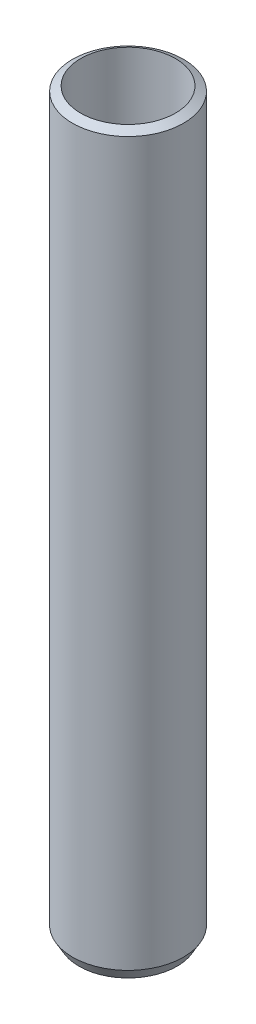
ISO-10303-21;
HEADER;
FILE_DESCRIPTION(('STEP AP214'),'2;1');
FILE_NAME('part.step','',(''),(''),'','','');
FILE_SCHEMA(('AUTOMOTIVE_DESIGN { 1 0 10303 214 1 1 1 1 }'));
ENDSEC;
DATA;
#1=APPLICATION_CONTEXT('core data for automotive mechanical design processes');
#2=APPLICATION_PROTOCOL_DEFINITION('international standard','automotive_design',2000,#1);
#3=PRODUCT_CONTEXT('',#1,'mechanical');
#4=PRODUCT('Part','Part','',(#3));
#5=PRODUCT_RELATED_PRODUCT_CATEGORY('part','',(#4));
#6=PRODUCT_DEFINITION_FORMATION('','',#4);
#7=PRODUCT_DEFINITION_CONTEXT('part definition',#1,'design');
#8=PRODUCT_DEFINITION('design','',#6,#7);
#9=PRODUCT_DEFINITION_SHAPE('','',#8);
#10=(LENGTH_UNIT() NAMED_UNIT(*) SI_UNIT(.MILLI.,.METRE.));
#11=(NAMED_UNIT(*) PLANE_ANGLE_UNIT() SI_UNIT($,.RADIAN.));
#12=(NAMED_UNIT(*) SI_UNIT($,.STERADIAN.) SOLID_ANGLE_UNIT());
#13=UNCERTAINTY_MEASURE_WITH_UNIT(LENGTH_MEASURE(1.E-05),#10,'distance_accuracy_value','');
#14=(GEOMETRIC_REPRESENTATION_CONTEXT(3) GLOBAL_UNCERTAINTY_ASSIGNED_CONTEXT((#13)) GLOBAL_UNIT_ASSIGNED_CONTEXT((#10,
#11,#12)) REPRESENTATION_CONTEXT('',''));
#15=CARTESIAN_POINT('',(0.,0.,0.));
#16=DIRECTION('',(0.,0.,1.));
#17=DIRECTION('',(1.,0.,0.));
#18=AXIS2_PLACEMENT_3D('',#15,#16,#17);
#19=CARTESIAN_POINT('',(0.,600.,0.));
#20=DIRECTION('',(0.,-1.,0.));
#21=DIRECTION('',(0.,0.,-1.));
#22=AXIS2_PLACEMENT_3D('',#19,#20,#21);
#23=CYLINDRICAL_SURFACE('',#22,45.);
#24=CARTESIAN_POINT('',(0.,594.780296499241,0.));
#25=DIRECTION('',(0.,1.,0.));
#26=DIRECTION('',(0.,0.,1.));
#27=AXIS2_PLACEMENT_3D('',#24,#25,#26);
#28=CIRCLE('',#27,45.);
#29=CARTESIAN_POINT('',(0.,594.780296499241,-45.0000000000001));
#30=VERTEX_POINT('',#29);
#31=EDGE_CURVE('E50',#30,#30,#28,.F.);
#32=ORIENTED_EDGE('',*,*,#31,.T.);
#33=EDGE_LOOP('',(#32));
#34=FACE_BOUND('',#33,.T.);
#35=CARTESIAN_POINT('',(0.,9.04079166376015,0.));
#36=DIRECTION('',(0.,1.,0.));
#37=DIRECTION('',(0.,0.,1.));
#38=AXIS2_PLACEMENT_3D('',#35,#36,#37);
#39=CIRCLE('',#38,45.);
#40=CARTESIAN_POINT('',(0.,9.04079166376015,45.));
#41=VERTEX_POINT('',#40);
#42=EDGE_CURVE('E51',#41,#41,#39,.T.);
#43=ORIENTED_EDGE('',*,*,#42,.T.);
#44=EDGE_LOOP('',(#43));
#45=FACE_BOUND('',#44,.T.);
#46=ADVANCED_FACE('F39',(#34,#45),#23,.T.);
#47=CARTESIAN_POINT('',(0.,0.,0.));
#48=DIRECTION('',(0.,1.,0.));
#49=DIRECTION('',(0.,0.,1.));
#50=AXIS2_PLACEMENT_3D('',#47,#48,#49);
#51=PLANE('',#50);
#52=CARTESIAN_POINT('',(0.,0.,0.));
#53=DIRECTION('',(0.,1.,0.));
#54=DIRECTION('',(0.,0.,1.));
#55=AXIS2_PLACEMENT_3D('',#52,#53,#54);
#56=CIRCLE('',#55,39.7802964992408);
#57=CARTESIAN_POINT('',(0.,0.,39.7802964992408));
#58=VERTEX_POINT('',#57);
#59=EDGE_CURVE('E10',#58,#58,#56,.F.);
#60=ORIENTED_EDGE('',*,*,#59,.T.);
#61=EDGE_LOOP('',(#60));
#62=FACE_BOUND('',#61,.T.);
#63=CARTESIAN_POINT('',(0.,0.,0.));
#64=DIRECTION('',(0.,1.,0.));
#65=DIRECTION('',(0.,0.,1.));
#66=AXIS2_PLACEMENT_3D('',#63,#64,#65);
#67=CIRCLE('',#66,38.4232853683676);
#68=CARTESIAN_POINT('',(0.,0.,38.4232853683676));
#69=VERTEX_POINT('',#68);
#70=EDGE_CURVE('E58',#69,#69,#67,.T.);
#71=ORIENTED_EDGE('',*,*,#70,.T.);
#72=EDGE_LOOP('',(#71));
#73=FACE_BOUND('',#72,.T.);
#74=ADVANCED_FACE('F62',(#62,#73),#51,.F.);
#75=CARTESIAN_POINT('',(0.,600.,0.));
#76=DIRECTION('',(0.,-1.,0.));
#77=DIRECTION('',(0.,0.,-1.));
#78=AXIS2_PLACEMENT_3D('',#75,#76,#77);
#79=CYLINDRICAL_SURFACE('',#78,38.4232853683676);
#80=CARTESIAN_POINT('',(0.,598.577364462197,0.));
#81=DIRECTION('',(0.,-1.,0.));
#82=DIRECTION('',(0.,0.,-1.));
#83=AXIS2_PLACEMENT_3D('',#80,#81,#82);
#84=CIRCLE('',#83,38.4232853683676);
#85=CARTESIAN_POINT('',(0.,598.577364462197,-38.4232853683675));
#86=VERTEX_POINT('',#85);
#87=EDGE_CURVE('E54',#86,#86,#84,.F.);
#88=ORIENTED_EDGE('',*,*,#87,.T.);
#89=EDGE_LOOP('',(#88));
#90=FACE_BOUND('',#89,.T.);
#91=ORIENTED_EDGE('',*,*,#70,.F.);
#92=EDGE_LOOP('',(#91));
#93=FACE_BOUND('',#92,.T.);
#94=ADVANCED_FACE('F68',(#90,#93),#79,.F.);
#95=CARTESIAN_POINT('',(0.,600.,0.));
#96=DIRECTION('',(0.,-1.,0.));
#97=DIRECTION('',(0.,0.,-1.));
#98=AXIS2_PLACEMENT_3D('',#95,#96,#97);
#99=CONICAL_SURFACE('',#98,35.95920833624,1.0471975511966);
#100=CARTESIAN_POINT('',(0.,594.780296499241,-45.0000000000001));
#101=CARTESIAN_POINT('',(0.,594.819849290521,-44.9314925559206));
#102=CARTESIAN_POINT('',(0.,594.859402081802,-44.8629851118411));
#103=CARTESIAN_POINT('',(0.,594.938507664364,-44.7259702236821));
#104=CARTESIAN_POINT('',(0.,594.978060455645,-44.6574627796026));
#105=CARTESIAN_POINT('',(0.,595.057166038206,-44.5204478914436));
#106=CARTESIAN_POINT('',(0.,595.096718829487,-44.4519404473641));
#107=CARTESIAN_POINT('',(0.,595.175824412049,-44.3149255592051));
#108=CARTESIAN_POINT('',(0.,595.215377203329,-44.2464181151255));
#109=CARTESIAN_POINT('',(0.,595.294482785891,-44.1094032269665));
#110=CARTESIAN_POINT('',(0.,595.334035577172,-44.040895782887));
#111=CARTESIAN_POINT('',(0.,595.413141159733,-43.903880894728));
#112=CARTESIAN_POINT('',(0.,595.452693951014,-43.8353734506485));
#113=CARTESIAN_POINT('',(0.,595.531799533576,-43.6983585624895));
#114=CARTESIAN_POINT('',(0.,595.571352324857,-43.62985111841));
#115=CARTESIAN_POINT('',(0.,595.650457907418,-43.492836230251));
#116=CARTESIAN_POINT('',(0.,595.690010698699,-43.4243287861715));
#117=CARTESIAN_POINT('',(0.,595.769116281261,-43.2873138980125));
#118=CARTESIAN_POINT('',(0.,595.808669072542,-43.2188064539329));
#119=CARTESIAN_POINT('',(0.,595.887774655103,-43.0817915657739));
#120=CARTESIAN_POINT('',(0.,595.927327446384,-43.0132841216944));
#121=CARTESIAN_POINT('',(0.,596.006433028945,-42.8762692335354));
#122=CARTESIAN_POINT('',(0.,596.045985820226,-42.8077617894559));
#123=CARTESIAN_POINT('',(0.,596.125091402788,-42.6707469012969));
#124=CARTESIAN_POINT('',(0.,596.164644194069,-42.6022394572174));
#125=CARTESIAN_POINT('',(0.,596.24374977663,-42.4652245690584));
#126=CARTESIAN_POINT('',(0.,596.283302567911,-42.3967171249789));
#127=CARTESIAN_POINT('',(0.,596.362408150473,-42.2597022368199));
#128=CARTESIAN_POINT('',(0.,596.401960941753,-42.1911947927404));
#129=CARTESIAN_POINT('',(0.,596.481066524315,-42.0541799045813));
#130=CARTESIAN_POINT('',(0.,596.520619315596,-41.9856724605019));
#131=CARTESIAN_POINT('',(0.,596.599724898157,-41.8486575723428));
#132=CARTESIAN_POINT('',(0.,596.639277689438,-41.7801501282633));
#133=CARTESIAN_POINT('',(0.,596.718383272,-41.6431352401043));
#134=CARTESIAN_POINT('',(0.,596.757936063281,-41.5746277960248));
#135=CARTESIAN_POINT('',(0.,596.837041645842,-41.4376129078658));
#136=CARTESIAN_POINT('',(0.,596.876594437123,-41.3691054637863));
#137=CARTESIAN_POINT('',(0.,596.955700019684,-41.2320905756273));
#138=CARTESIAN_POINT('',(0.,596.995252810965,-41.1635831315478));
#139=CARTESIAN_POINT('',(0.,597.074358393527,-41.0265682433888));
#140=CARTESIAN_POINT('',(0.,597.113911184808,-40.9580607993093));
#141=CARTESIAN_POINT('',(0.,597.193016767369,-40.8210459111502));
#142=CARTESIAN_POINT('',(0.,597.23256955865,-40.7525384670707));
#143=CARTESIAN_POINT('',(0.,597.311675141212,-40.6155235789117));
#144=CARTESIAN_POINT('',(0.,597.351227932493,-40.5470161348322));
#145=CARTESIAN_POINT('',(0.,597.430333515054,-40.4100012466732));
#146=CARTESIAN_POINT('',(0.,597.469886306335,-40.3414938025937));
#147=CARTESIAN_POINT('',(0.,597.548991888896,-40.2044789144347));
#148=CARTESIAN_POINT('',(0.,597.588544680177,-40.1359714703552));
#149=CARTESIAN_POINT('',(0.,597.667650262739,-39.9989565821962));
#150=CARTESIAN_POINT('',(0.,597.70720305402,-39.9304491381167));
#151=CARTESIAN_POINT('',(0.,597.786308636581,-39.7934342499576));
#152=CARTESIAN_POINT('',(0.,597.825861427862,-39.7249268058781));
#153=CARTESIAN_POINT('',(0.,597.904967010424,-39.5879119177191));
#154=CARTESIAN_POINT('',(0.,597.944519801704,-39.5194044736396));
#155=CARTESIAN_POINT('',(0.,598.023625384266,-39.3823895854806));
#156=CARTESIAN_POINT('',(0.,598.063178175547,-39.3138821414011));
#157=CARTESIAN_POINT('',(0.,598.142283758108,-39.1768672532421));
#158=CARTESIAN_POINT('',(0.,598.181836549389,-39.1083598091626));
#159=CARTESIAN_POINT('',(0.,598.260942131951,-38.9713449210036));
#160=CARTESIAN_POINT('',(0.,598.300494923232,-38.9028374769241));
#161=CARTESIAN_POINT('',(0.,598.379600505793,-38.7658225887651));
#162=CARTESIAN_POINT('',(0.,598.419153297074,-38.6973151446856));
#163=CARTESIAN_POINT('',(0.,598.498258879636,-38.5603002565265));
#164=CARTESIAN_POINT('',(0.,598.537811670916,-38.4917928124471));
#165=CARTESIAN_POINT('',(0.,598.577364462197,-38.4232853683675));
#166=B_SPLINE_CURVE_WITH_KNOTS('',3,(#100,#101,#102,#103,#104,#105,#106,#107,#108,#109,#110,
#111,#112,#113,#114,#115,#116,#117,#118,#119,#120,#121,#122,#123,#124,#125,#126,#127,#128,#129,
#130,#131,#132,#133,#134,#135,#136,#137,#138,#139,#140,#141,#142,#143,#144,#145,#146,#147,#148,
#149,#150,#151,#152,#153,#154,#155,#156,#157,#158,#159,#160,#161,#162,#163,#164,#165),
.UNSPECIFIED.,.F.,.F.,(4,2,2,2,2,2,2,2,2,2,2,2,2,2,2,2,2,2,2,2,2,2,2,2,2,2,2,2,2,2,2,2,4),(0.,
0.237316747684776,0.474633495369559,0.711950243054335,0.949266990739117,1.1865837384239,
1.42390048610868,1.66121723379346,1.89853398147823,2.13585072916302,2.37316747684779,
2.61048422453258,2.84780097221736,3.08511771990214,3.32243446758692,3.55975121527169,
3.79706796295642,4.0343847106412,4.27170145832598,4.50901820601076,4.74633495369554,
4.98365170138032,5.2209684490651,5.45828519674988,5.69560194443466,5.93291869211944,
6.17023543980422,6.407552187489,6.64486893517378,6.88218568285856,7.11950243054334,
7.35681917822812,7.59413592591284),.UNSPECIFIED.);
#167=EDGE_CURVE('BSEAM66',#30,#86,#166,.T.);
#168=ORIENTED_EDGE('',*,*,#31,.F.);
#169=ORIENTED_EDGE('',*,*,#87,.F.);
#170=ORIENTED_EDGE('',*,*,#167,.T.);
#171=ORIENTED_EDGE('',*,*,#167,.F.);
#172=EDGE_LOOP('',(#168,#170,#169,#171));
#173=FACE_BOUND('',#172,.T.);
#174=ADVANCED_FACE('F66',(#173),#99,.T.);
#175=CARTESIAN_POINT('',(0.,9.04079166376015,0.));
#176=DIRECTION('',(0.,1.,0.));
#177=DIRECTION('',(0.,0.,1.));
#178=AXIS2_PLACEMENT_3D('',#175,#176,#177);
#179=CONICAL_SURFACE('',#178,45.,0.523598775598299);
#180=ORIENTED_EDGE('',*,*,#59,.F.);
#181=EDGE_LOOP('',(#180));
#182=FACE_BOUND('',#181,.T.);
#183=ORIENTED_EDGE('',*,*,#42,.F.);
#184=EDGE_LOOP('',(#183));
#185=FACE_BOUND('',#184,.T.);
#186=ADVANCED_FACE('F45',(#182,#185),#179,.T.);
#187=CLOSED_SHELL('',(#46,#74,#94,#174,#186));
#188=MANIFOLD_SOLID_BREP('B2',#187);
#189=ADVANCED_BREP_SHAPE_REPRESENTATION('',(#18,#188),#14);
#190=SHAPE_DEFINITION_REPRESENTATION(#9,#189);
ENDSEC;
END-ISO-10303-21;
